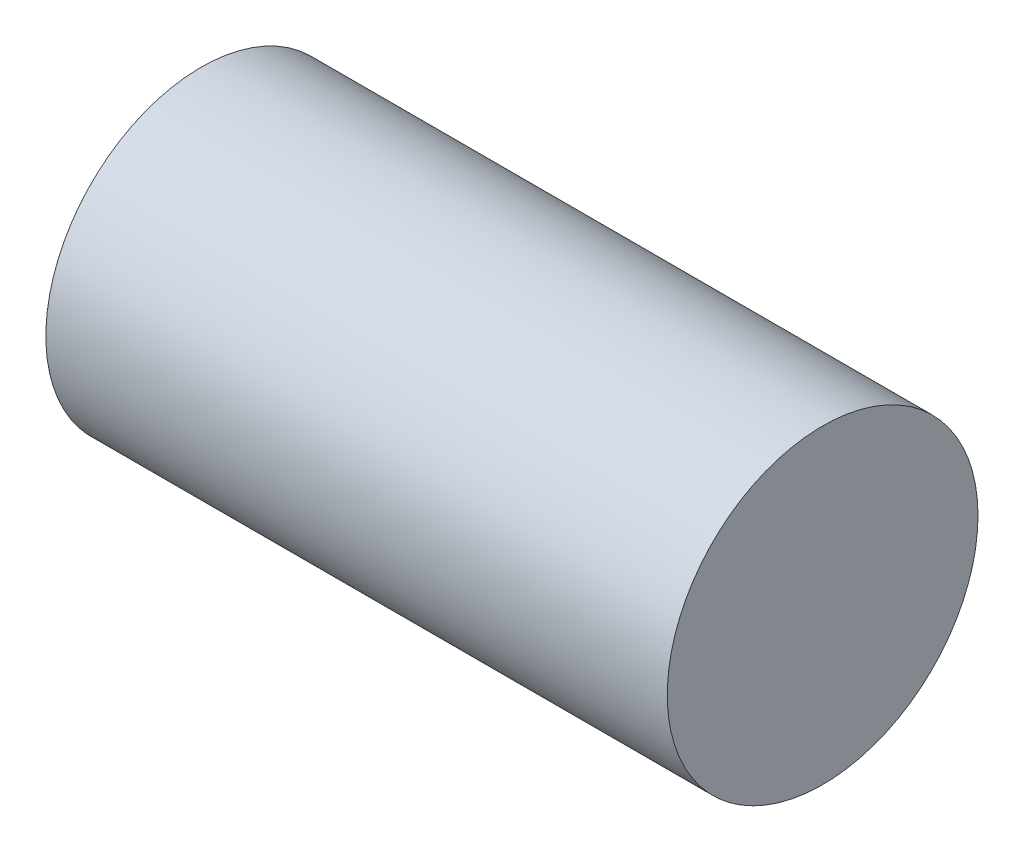
ISO-10303-21;
HEADER;
FILE_DESCRIPTION(('STEP AP214'),'2;1');
FILE_NAME('part.step','',(''),(''),'','','');
FILE_SCHEMA(('AUTOMOTIVE_DESIGN { 1 0 10303 214 1 1 1 1 }'));
ENDSEC;
DATA;
#1=APPLICATION_CONTEXT('core data for automotive mechanical design processes');
#2=APPLICATION_PROTOCOL_DEFINITION('international standard','automotive_design',2000,#1);
#3=PRODUCT_CONTEXT('',#1,'mechanical');
#4=PRODUCT('Part','Part','',(#3));
#5=PRODUCT_RELATED_PRODUCT_CATEGORY('part','',(#4));
#6=PRODUCT_DEFINITION_FORMATION('','',#4);
#7=PRODUCT_DEFINITION_CONTEXT('part definition',#1,'design');
#8=PRODUCT_DEFINITION('design','',#6,#7);
#9=PRODUCT_DEFINITION_SHAPE('','',#8);
#10=(LENGTH_UNIT() NAMED_UNIT(*) SI_UNIT(.MILLI.,.METRE.));
#11=(NAMED_UNIT(*) PLANE_ANGLE_UNIT() SI_UNIT($,.RADIAN.));
#12=(NAMED_UNIT(*) SI_UNIT($,.STERADIAN.) SOLID_ANGLE_UNIT());
#13=UNCERTAINTY_MEASURE_WITH_UNIT(LENGTH_MEASURE(1.E-05),#10,'distance_accuracy_value','');
#14=(GEOMETRIC_REPRESENTATION_CONTEXT(3) GLOBAL_UNCERTAINTY_ASSIGNED_CONTEXT((#13)) GLOBAL_UNIT_ASSIGNED_CONTEXT((#10,
#11,#12)) REPRESENTATION_CONTEXT('',''));
#15=CARTESIAN_POINT('',(0.,0.,0.));
#16=DIRECTION('',(0.,0.,1.));
#17=DIRECTION('',(1.,0.,0.));
#18=AXIS2_PLACEMENT_3D('',#15,#16,#17);
#19=CARTESIAN_POINT('',(9.525,0.,0.));
#20=DIRECTION('',(-1.,0.,0.));
#21=DIRECTION('',(0.,0.,1.));
#22=AXIS2_PLACEMENT_3D('',#19,#20,#21);
#23=CYLINDRICAL_SURFACE('',#22,2.38125);
#24=CARTESIAN_POINT('',(9.525,0.,0.));
#25=DIRECTION('',(1.,0.,0.));
#26=DIRECTION('',(0.,0.,-1.));
#27=AXIS2_PLACEMENT_3D('',#24,#25,#26);
#28=CIRCLE('',#27,2.38125);
#29=CARTESIAN_POINT('',(9.525,0.,-2.38125));
#30=VERTEX_POINT('',#29);
#31=EDGE_CURVE('E10',#30,#30,#28,.T.);
#32=ORIENTED_EDGE('',*,*,#31,.F.);
#33=EDGE_LOOP('',(#32));
#34=FACE_BOUND('',#33,.T.);
#35=CARTESIAN_POINT('',(0.,0.,0.));
#36=DIRECTION('',(1.,0.,0.));
#37=DIRECTION('',(0.,0.,-1.));
#38=AXIS2_PLACEMENT_3D('',#35,#36,#37);
#39=CIRCLE('',#38,2.38125);
#40=CARTESIAN_POINT('',(0.,0.,-2.38125));
#41=VERTEX_POINT('',#40);
#42=EDGE_CURVE('E44',#41,#41,#39,.T.);
#43=ORIENTED_EDGE('',*,*,#42,.T.);
#44=EDGE_LOOP('',(#43));
#45=FACE_BOUND('',#44,.T.);
#46=ADVANCED_FACE('F41',(#34,#45),#23,.T.);
#47=CARTESIAN_POINT('',(9.525,0.,0.));
#48=DIRECTION('',(1.,0.,0.));
#49=DIRECTION('',(0.,0.,-1.));
#50=AXIS2_PLACEMENT_3D('',#47,#48,#49);
#51=PLANE('',#50);
#52=ORIENTED_EDGE('',*,*,#31,.T.);
#53=EDGE_LOOP('',(#52));
#54=FACE_BOUND('',#53,.T.);
#55=ADVANCED_FACE('F58',(#54),#51,.T.);
#56=CARTESIAN_POINT('',(0.,0.,0.));
#57=DIRECTION('',(1.,0.,0.));
#58=DIRECTION('',(0.,0.,-1.));
#59=AXIS2_PLACEMENT_3D('',#56,#57,#58);
#60=PLANE('',#59);
#61=ORIENTED_EDGE('',*,*,#42,.F.);
#62=EDGE_LOOP('',(#61));
#63=FACE_BOUND('',#62,.T.);
#64=ADVANCED_FACE('F56',(#63),#60,.F.);
#65=CLOSED_SHELL('',(#46,#55,#64));
#66=MANIFOLD_SOLID_BREP('B2',#65);
#67=ADVANCED_BREP_SHAPE_REPRESENTATION('',(#18,#66),#14);
#68=SHAPE_DEFINITION_REPRESENTATION(#9,#67);
ENDSEC;
END-ISO-10303-21;
